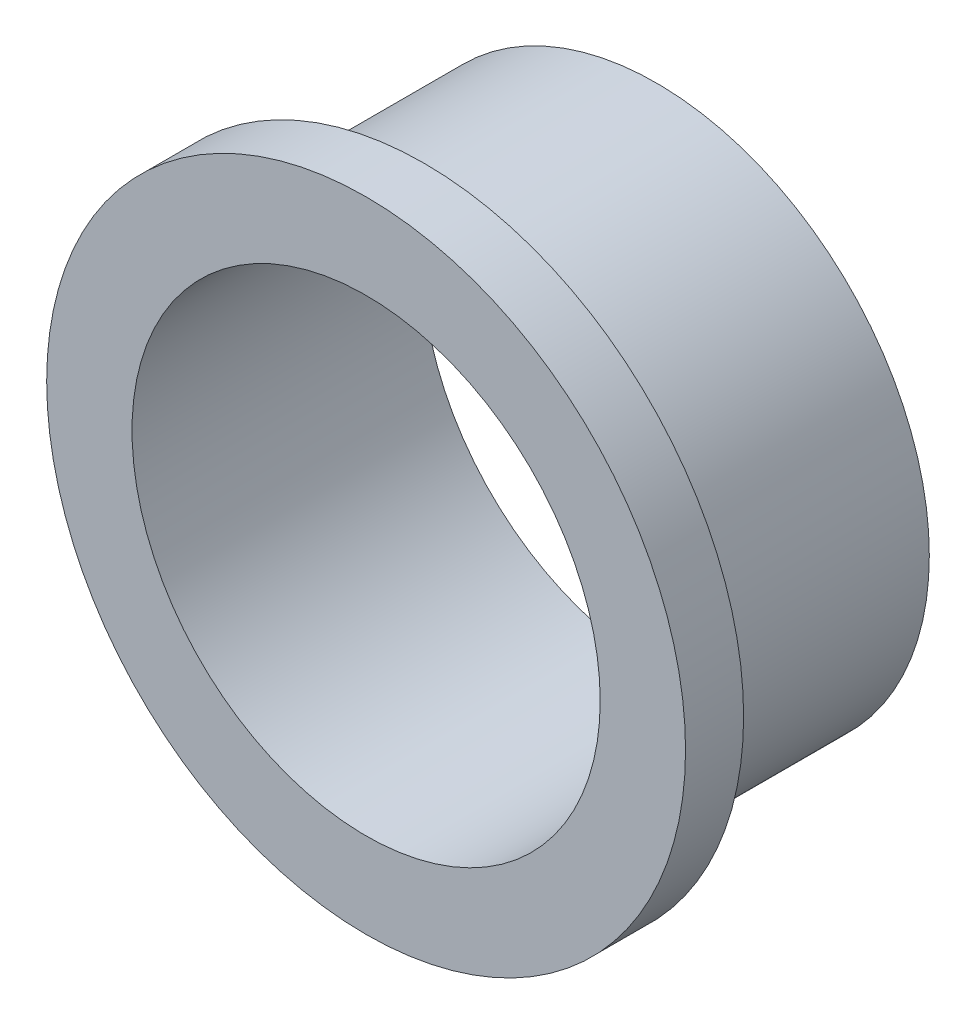
ISO-10303-21;
HEADER;
FILE_DESCRIPTION(('STEP AP214'),'2;1');
FILE_NAME('part.step','',(''),(''),'','','');
FILE_SCHEMA(('AUTOMOTIVE_DESIGN { 1 0 10303 214 1 1 1 1 }'));
ENDSEC;
DATA;
#1=APPLICATION_CONTEXT('core data for automotive mechanical design processes');
#2=APPLICATION_PROTOCOL_DEFINITION('international standard','automotive_design',2000,#1);
#3=PRODUCT_CONTEXT('',#1,'mechanical');
#4=PRODUCT('Part','Part','',(#3));
#5=PRODUCT_RELATED_PRODUCT_CATEGORY('part','',(#4));
#6=PRODUCT_DEFINITION_FORMATION('','',#4);
#7=PRODUCT_DEFINITION_CONTEXT('part definition',#1,'design');
#8=PRODUCT_DEFINITION('design','',#6,#7);
#9=PRODUCT_DEFINITION_SHAPE('','',#8);
#10=(LENGTH_UNIT() NAMED_UNIT(*) SI_UNIT(.MILLI.,.METRE.));
#11=(NAMED_UNIT(*) PLANE_ANGLE_UNIT() SI_UNIT($,.RADIAN.));
#12=(NAMED_UNIT(*) SI_UNIT($,.STERADIAN.) SOLID_ANGLE_UNIT());
#13=UNCERTAINTY_MEASURE_WITH_UNIT(LENGTH_MEASURE(1.E-05),#10,'distance_accuracy_value','');
#14=(GEOMETRIC_REPRESENTATION_CONTEXT(3) GLOBAL_UNCERTAINTY_ASSIGNED_CONTEXT((#13)) GLOBAL_UNIT_ASSIGNED_CONTEXT((#10,
#11,#12)) REPRESENTATION_CONTEXT('',''));
#15=CARTESIAN_POINT('',(0.,0.,0.));
#16=DIRECTION('',(0.,0.,1.));
#17=DIRECTION('',(1.,0.,0.));
#18=AXIS2_PLACEMENT_3D('',#15,#16,#17);
#19=CARTESIAN_POINT('',(0.,0.,0.));
#20=DIRECTION('',(0.,0.,1.));
#21=DIRECTION('',(1.,0.,0.));
#22=AXIS2_PLACEMENT_3D('',#19,#20,#21);
#23=CYLINDRICAL_SURFACE('',#22,6.14261856656422);
#24=CARTESIAN_POINT('',(0.,0.,1.524));
#25=DIRECTION('',(0.,0.,1.));
#26=DIRECTION('',(1.,0.,0.));
#27=AXIS2_PLACEMENT_3D('',#24,#25,#26);
#28=CIRCLE('',#27,6.14261856656422);
#29=CARTESIAN_POINT('',(6.14261856656422,0.,1.524));
#30=VERTEX_POINT('',#29);
#31=EDGE_CURVE('E63',#30,#30,#28,.T.);
#32=ORIENTED_EDGE('',*,*,#31,.T.);
#33=EDGE_LOOP('',(#32));
#34=FACE_BOUND('',#33,.T.);
#35=CARTESIAN_POINT('',(0.,0.,-6.096));
#36=DIRECTION('',(0.,0.,1.));
#37=DIRECTION('',(1.,0.,0.));
#38=AXIS2_PLACEMENT_3D('',#35,#36,#37);
#39=CIRCLE('',#38,6.14261856656422);
#40=CARTESIAN_POINT('',(6.14261856656422,0.,-6.096));
#41=VERTEX_POINT('',#40);
#42=EDGE_CURVE('E10',#41,#41,#39,.T.);
#43=ORIENTED_EDGE('',*,*,#42,.F.);
#44=EDGE_LOOP('',(#43));
#45=FACE_BOUND('',#44,.T.);
#46=ADVANCED_FACE('F41',(#34,#45),#23,.F.);
#47=CARTESIAN_POINT('',(7.15861856656422,0.,-6.096));
#48=DIRECTION('',(0.,0.,-1.));
#49=DIRECTION('',(-1.,0.,0.));
#50=AXIS2_PLACEMENT_3D('',#47,#48,#49);
#51=PLANE('',#50);
#52=ORIENTED_EDGE('',*,*,#42,.T.);
#53=EDGE_LOOP('',(#52));
#54=FACE_BOUND('',#53,.T.);
#55=CARTESIAN_POINT('',(0.,0.,-6.096));
#56=DIRECTION('',(0.,0.,1.));
#57=DIRECTION('',(1.,0.,0.));
#58=AXIS2_PLACEMENT_3D('',#55,#56,#57);
#59=CIRCLE('',#58,7.15861856656422);
#60=CARTESIAN_POINT('',(7.15861856656422,0.,-6.096));
#61=VERTEX_POINT('',#60);
#62=EDGE_CURVE('E47',#61,#61,#59,.T.);
#63=ORIENTED_EDGE('',*,*,#62,.F.);
#64=EDGE_LOOP('',(#63));
#65=FACE_BOUND('',#64,.T.);
#66=ADVANCED_FACE('F81',(#54,#65),#51,.T.);
#67=CARTESIAN_POINT('',(0.,0.,0.));
#68=DIRECTION('',(0.,0.,1.));
#69=DIRECTION('',(1.,0.,0.));
#70=AXIS2_PLACEMENT_3D('',#67,#68,#69);
#71=CYLINDRICAL_SURFACE('',#70,7.15861856656422);
#72=ORIENTED_EDGE('',*,*,#62,.T.);
#73=EDGE_LOOP('',(#72));
#74=FACE_BOUND('',#73,.T.);
#75=CARTESIAN_POINT('',(0.,0.,0.));
#76=DIRECTION('',(0.,0.,1.));
#77=DIRECTION('',(1.,0.,0.));
#78=AXIS2_PLACEMENT_3D('',#75,#76,#77);
#79=CIRCLE('',#78,7.15861856656422);
#80=CARTESIAN_POINT('',(7.15861856656422,0.,0.));
#81=VERTEX_POINT('',#80);
#82=EDGE_CURVE('E51',#81,#81,#79,.T.);
#83=ORIENTED_EDGE('',*,*,#82,.F.);
#84=EDGE_LOOP('',(#83));
#85=FACE_BOUND('',#84,.T.);
#86=ADVANCED_FACE('F85',(#74,#85),#71,.T.);
#87=CARTESIAN_POINT('',(7.15861856656422,0.,0.));
#88=DIRECTION('',(0.,0.,1.));
#89=DIRECTION('',(1.,0.,0.));
#90=AXIS2_PLACEMENT_3D('',#87,#88,#89);
#91=PLANE('',#90);
#92=CARTESIAN_POINT('',(0.,0.,0.));
#93=DIRECTION('',(0.,0.,1.));
#94=DIRECTION('',(1.,0.,0.));
#95=AXIS2_PLACEMENT_3D('',#92,#93,#94);
#96=CIRCLE('',#95,8.382);
#97=CARTESIAN_POINT('',(8.382,0.,0.));
#98=VERTEX_POINT('',#97);
#99=EDGE_CURVE('E55',#98,#98,#96,.T.);
#100=ORIENTED_EDGE('',*,*,#99,.F.);
#101=EDGE_LOOP('',(#100));
#102=FACE_BOUND('',#101,.T.);
#103=ORIENTED_EDGE('',*,*,#82,.T.);
#104=EDGE_LOOP('',(#103));
#105=FACE_BOUND('',#104,.T.);
#106=ADVANCED_FACE('F77',(#102,#105),#91,.F.);
#107=CARTESIAN_POINT('',(0.,0.,0.));
#108=DIRECTION('',(0.,0.,1.));
#109=DIRECTION('',(1.,0.,0.));
#110=AXIS2_PLACEMENT_3D('',#107,#108,#109);
#111=CYLINDRICAL_SURFACE('',#110,8.382);
#112=ORIENTED_EDGE('',*,*,#99,.T.);
#113=EDGE_LOOP('',(#112));
#114=FACE_BOUND('',#113,.T.);
#115=CARTESIAN_POINT('',(0.,0.,1.524));
#116=DIRECTION('',(0.,0.,1.));
#117=DIRECTION('',(1.,0.,0.));
#118=AXIS2_PLACEMENT_3D('',#115,#116,#117);
#119=CIRCLE('',#118,8.382);
#120=CARTESIAN_POINT('',(8.382,0.,1.524));
#121=VERTEX_POINT('',#120);
#122=EDGE_CURVE('E60',#121,#121,#119,.T.);
#123=ORIENTED_EDGE('',*,*,#122,.F.);
#124=EDGE_LOOP('',(#123));
#125=FACE_BOUND('',#124,.T.);
#126=ADVANCED_FACE('F71',(#114,#125),#111,.T.);
#127=CARTESIAN_POINT('',(6.14261856656422,0.,1.524));
#128=DIRECTION('',(0.,0.,1.));
#129=DIRECTION('',(1.,0.,0.));
#130=AXIS2_PLACEMENT_3D('',#127,#128,#129);
#131=PLANE('',#130);
#132=ORIENTED_EDGE('',*,*,#122,.T.);
#133=EDGE_LOOP('',(#132));
#134=FACE_BOUND('',#133,.T.);
#135=ORIENTED_EDGE('',*,*,#31,.F.);
#136=EDGE_LOOP('',(#135));
#137=FACE_BOUND('',#136,.T.);
#138=ADVANCED_FACE('F69',(#134,#137),#131,.T.);
#139=CLOSED_SHELL('',(#46,#66,#86,#106,#126,#138));
#140=MANIFOLD_SOLID_BREP('B2',#139);
#141=ADVANCED_BREP_SHAPE_REPRESENTATION('',(#18,#140),#14);
#142=SHAPE_DEFINITION_REPRESENTATION(#9,#141);
ENDSEC;
END-ISO-10303-21;
